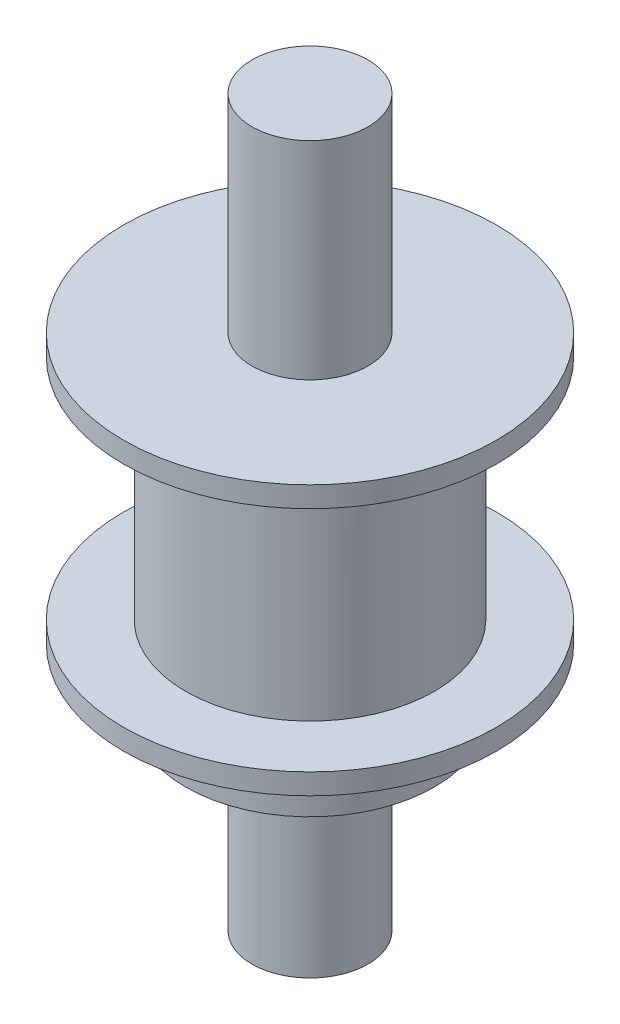
ISO-10303-21;
HEADER;
FILE_DESCRIPTION(('STEP AP214'),'2;1');
FILE_NAME('part.step','',(''),(''),'','','');
FILE_SCHEMA(('AUTOMOTIVE_DESIGN { 1 0 10303 214 1 1 1 1 }'));
ENDSEC;
DATA;
#1=APPLICATION_CONTEXT('core data for automotive mechanical design processes');
#2=APPLICATION_PROTOCOL_DEFINITION('international standard','automotive_design',2000,#1);
#3=PRODUCT_CONTEXT('',#1,'mechanical');
#4=PRODUCT('Part','Part','',(#3));
#5=PRODUCT_RELATED_PRODUCT_CATEGORY('part','',(#4));
#6=PRODUCT_DEFINITION_FORMATION('','',#4);
#7=PRODUCT_DEFINITION_CONTEXT('part definition',#1,'design');
#8=PRODUCT_DEFINITION('design','',#6,#7);
#9=PRODUCT_DEFINITION_SHAPE('','',#8);
#10=(LENGTH_UNIT() NAMED_UNIT(*) SI_UNIT(.MILLI.,.METRE.));
#11=(NAMED_UNIT(*) PLANE_ANGLE_UNIT() SI_UNIT($,.RADIAN.));
#12=(NAMED_UNIT(*) SI_UNIT($,.STERADIAN.) SOLID_ANGLE_UNIT());
#13=UNCERTAINTY_MEASURE_WITH_UNIT(LENGTH_MEASURE(1.E-05),#10,'distance_accuracy_value','');
#14=(GEOMETRIC_REPRESENTATION_CONTEXT(3) GLOBAL_UNCERTAINTY_ASSIGNED_CONTEXT((#13)) GLOBAL_UNIT_ASSIGNED_CONTEXT((#10,
#11,#12)) REPRESENTATION_CONTEXT('',''));
#15=CARTESIAN_POINT('',(0.,0.,0.));
#16=DIRECTION('',(0.,0.,1.));
#17=DIRECTION('',(1.,0.,0.));
#18=AXIS2_PLACEMENT_3D('',#15,#16,#17);
#19=CARTESIAN_POINT('',(-48.,37.9705627484775,40.));
#20=DIRECTION('',(0.,-1.,0.));
#21=DIRECTION('',(0.,0.,-1.));
#22=AXIS2_PLACEMENT_3D('',#19,#20,#21);
#23=CYLINDRICAL_SURFACE('',#22,6.);
#24=CARTESIAN_POINT('',(-48.,17.,40.));
#25=DIRECTION('',(0.,1.,0.));
#26=DIRECTION('',(0.,0.,1.));
#27=AXIS2_PLACEMENT_3D('',#24,#25,#26);
#28=CIRCLE('',#27,6.);
#29=CARTESIAN_POINT('',(-48.,17.,46.));
#30=VERTEX_POINT('',#29);
#31=EDGE_CURVE('E66',#30,#30,#28,.T.);
#32=ORIENTED_EDGE('',*,*,#31,.T.);
#33=EDGE_LOOP('',(#32));
#34=FACE_BOUND('',#33,.T.);
#35=CARTESIAN_POINT('',(-48.,20.0000000000004,40.));
#36=DIRECTION('',(0.,1.,0.));
#37=DIRECTION('',(0.,0.,1.));
#38=AXIS2_PLACEMENT_3D('',#35,#36,#37);
#39=CIRCLE('',#38,6.);
#40=CARTESIAN_POINT('',(-48.,20.0000000000004,46.));
#41=VERTEX_POINT('',#40);
#42=EDGE_CURVE('E40',#41,#41,#39,.T.);
#43=ORIENTED_EDGE('',*,*,#42,.F.);
#44=EDGE_LOOP('',(#43));
#45=FACE_BOUND('',#44,.T.);
#46=ADVANCED_FACE('F36',(#34,#45),#23,.T.);
#47=CARTESIAN_POINT('',(-48.,-1.91959594928934,40.));
#48=DIRECTION('',(0.,1.,0.));
#49=DIRECTION('',(0.,0.,1.));
#50=AXIS2_PLACEMENT_3D('',#47,#48,#49);
#51=CYLINDRICAL_SURFACE('',#50,2.80000000000001);
#52=CARTESIAN_POINT('',(-48.,8.,40.));
#53=DIRECTION('',(0.,1.,0.));
#54=DIRECTION('',(0.,0.,1.));
#55=AXIS2_PLACEMENT_3D('',#52,#53,#54);
#56=CIRCLE('',#55,2.80000000000001);
#57=CARTESIAN_POINT('',(-48.,8.,42.8));
#58=VERTEX_POINT('',#57);
#59=EDGE_CURVE('E73',#58,#58,#56,.F.);
#60=ORIENTED_EDGE('',*,*,#59,.F.);
#61=EDGE_LOOP('',(#60));
#62=FACE_BOUND('',#61,.T.);
#63=CARTESIAN_POINT('',(-48.,17.,40.));
#64=DIRECTION('',(0.,1.,0.));
#65=DIRECTION('',(0.,0.,1.));
#66=AXIS2_PLACEMENT_3D('',#63,#64,#65);
#67=CIRCLE('',#66,2.80000000000001);
#68=CARTESIAN_POINT('',(-48.,17.,42.8));
#69=VERTEX_POINT('',#68);
#70=EDGE_CURVE('E71',#69,#69,#67,.T.);
#71=ORIENTED_EDGE('',*,*,#70,.F.);
#72=EDGE_LOOP('',(#71));
#73=FACE_BOUND('',#72,.T.);
#74=ADVANCED_FACE('F38',(#62,#73),#51,.T.);
#75=CARTESIAN_POINT('',(0.,8.,0.));
#76=DIRECTION('',(0.,1.,0.));
#77=DIRECTION('',(0.,0.,1.));
#78=AXIS2_PLACEMENT_3D('',#75,#76,#77);
#79=PLANE('',#78);
#80=ORIENTED_EDGE('',*,*,#59,.T.);
#81=EDGE_LOOP('',(#80));
#82=FACE_BOUND('',#81,.T.);
#83=ADVANCED_FACE('F89',(#82),#79,.F.);
#84=CARTESIAN_POINT('',(0.,17.,0.));
#85=DIRECTION('',(0.,1.,0.));
#86=DIRECTION('',(0.,0.,1.));
#87=AXIS2_PLACEMENT_3D('',#84,#85,#86);
#88=PLANE('',#87);
#89=ORIENTED_EDGE('',*,*,#70,.T.);
#90=EDGE_LOOP('',(#89));
#91=FACE_BOUND('',#90,.T.);
#92=ORIENTED_EDGE('',*,*,#31,.F.);
#93=EDGE_LOOP('',(#92));
#94=FACE_BOUND('',#93,.T.);
#95=ADVANCED_FACE('F93',(#91,#94),#88,.F.);
#96=CARTESIAN_POINT('',(-48.,20.0000000000004,40.));
#97=DIRECTION('',(0.,1.,0.));
#98=DIRECTION('',(-1.,0.,0.));
#99=AXIS2_PLACEMENT_3D('',#96,#97,#98);
#100=CYLINDRICAL_SURFACE('',#99,9.00000000000001);
#101=CARTESIAN_POINT('',(-48.,20.0000000000004,40.));
#102=DIRECTION('',(0.,1.,0.));
#103=DIRECTION('',(0.,0.,1.));
#104=AXIS2_PLACEMENT_3D('',#101,#102,#103);
#105=CIRCLE('',#104,9.00000000000001);
#106=CARTESIAN_POINT('',(-48.,20.0000000000004,49.));
#107=VERTEX_POINT('',#106);
#108=EDGE_CURVE('E63',#107,#107,#105,.T.);
#109=ORIENTED_EDGE('',*,*,#108,.T.);
#110=EDGE_LOOP('',(#109));
#111=FACE_BOUND('',#110,.T.);
#112=CARTESIAN_POINT('',(-48.,21.0000000000004,40.));
#113=DIRECTION('',(0.,1.,0.));
#114=DIRECTION('',(0.,0.,1.));
#115=AXIS2_PLACEMENT_3D('',#112,#113,#114);
#116=CIRCLE('',#115,9.00000000000001);
#117=CARTESIAN_POINT('',(-48.,21.0000000000004,49.));
#118=VERTEX_POINT('',#117);
#119=EDGE_CURVE('E62',#118,#118,#116,.T.);
#120=ORIENTED_EDGE('',*,*,#119,.F.);
#121=EDGE_LOOP('',(#120));
#122=FACE_BOUND('',#121,.T.);
#123=ADVANCED_FACE('F103',(#111,#122),#100,.T.);
#124=CARTESIAN_POINT('',(0.,20.0000000000004,0.));
#125=DIRECTION('',(0.,1.,0.));
#126=DIRECTION('',(0.,0.,1.));
#127=AXIS2_PLACEMENT_3D('',#124,#125,#126);
#128=PLANE('',#127);
#129=ORIENTED_EDGE('',*,*,#42,.T.);
#130=EDGE_LOOP('',(#129));
#131=FACE_BOUND('',#130,.T.);
#132=ORIENTED_EDGE('',*,*,#108,.F.);
#133=EDGE_LOOP('',(#132));
#134=FACE_BOUND('',#133,.T.);
#135=ADVANCED_FACE('F80',(#131,#134),#128,.F.);
#136=CARTESIAN_POINT('',(-48.,21.0000000000004,1979.));
#137=DIRECTION('',(0.,1.,0.));
#138=DIRECTION('',(-1.,0.,0.));
#139=AXIS2_PLACEMENT_3D('',#136,#137,#138);
#140=PLANE('',#139);
#141=CARTESIAN_POINT('',(-48.,21.0000000000004,40.));
#142=DIRECTION('',(0.,1.,0.));
#143=DIRECTION('',(0.,0.,1.));
#144=AXIS2_PLACEMENT_3D('',#141,#142,#143);
#145=CIRCLE('',#144,6.);
#146=CARTESIAN_POINT('',(-48.,21.0000000000004,46.));
#147=VERTEX_POINT('',#146);
#148=EDGE_CURVE('E44',#147,#147,#145,.T.);
#149=ORIENTED_EDGE('',*,*,#148,.F.);
#150=EDGE_LOOP('',(#149));
#151=FACE_BOUND('',#150,.T.);
#152=ORIENTED_EDGE('',*,*,#119,.T.);
#153=EDGE_LOOP('',(#152));
#154=FACE_BOUND('',#153,.T.);
#155=ADVANCED_FACE('F95',(#151,#154),#140,.T.);
#156=CARTESIAN_POINT('',(-48.,48.9705627484775,40.));
#157=DIRECTION('',(0.,-1.,0.));
#158=DIRECTION('',(1.,0.,0.));
#159=AXIS2_PLACEMENT_3D('',#156,#157,#158);
#160=CYLINDRICAL_SURFACE('',#159,6.);
#161=ORIENTED_EDGE('',*,*,#148,.T.);
#162=EDGE_LOOP('',(#161));
#163=FACE_BOUND('',#162,.T.);
#164=CARTESIAN_POINT('',(-48.,32.0000000000004,40.));
#165=DIRECTION('',(0.,1.,0.));
#166=DIRECTION('',(-1.,0.,0.));
#167=AXIS2_PLACEMENT_3D('',#164,#165,#166);
#168=CIRCLE('',#167,6.);
#169=CARTESIAN_POINT('',(-54.,32.0000000000004,40.));
#170=VERTEX_POINT('',#169);
#171=EDGE_CURVE('E56',#170,#170,#168,.T.);
#172=ORIENTED_EDGE('',*,*,#171,.F.);
#173=EDGE_LOOP('',(#172));
#174=FACE_BOUND('',#173,.T.);
#175=ADVANCED_FACE('F97',(#163,#174),#160,.T.);
#176=CARTESIAN_POINT('',(-48.,33.0000000000004,40.));
#177=DIRECTION('',(0.,-1.,0.));
#178=DIRECTION('',(1.,0.,0.));
#179=AXIS2_PLACEMENT_3D('',#176,#177,#178);
#180=CYLINDRICAL_SURFACE('',#179,9.00000000000001);
#181=CARTESIAN_POINT('',(-48.,33.0000000000004,40.));
#182=DIRECTION('',(0.,1.,0.));
#183=DIRECTION('',(-1.,0.,0.));
#184=AXIS2_PLACEMENT_3D('',#181,#182,#183);
#185=CIRCLE('',#184,9.00000000000001);
#186=CARTESIAN_POINT('',(-57.,33.0000000000004,40.));
#187=VERTEX_POINT('',#186);
#188=EDGE_CURVE('E53',#187,#187,#185,.T.);
#189=ORIENTED_EDGE('',*,*,#188,.F.);
#190=EDGE_LOOP('',(#189));
#191=FACE_BOUND('',#190,.T.);
#192=CARTESIAN_POINT('',(-48.,32.0000000000004,40.));
#193=DIRECTION('',(0.,1.,0.));
#194=DIRECTION('',(-1.,0.,0.));
#195=AXIS2_PLACEMENT_3D('',#192,#193,#194);
#196=CIRCLE('',#195,9.00000000000001);
#197=CARTESIAN_POINT('',(-57.,32.0000000000004,40.));
#198=VERTEX_POINT('',#197);
#199=EDGE_CURVE('E57',#198,#198,#196,.T.);
#200=ORIENTED_EDGE('',*,*,#199,.T.);
#201=EDGE_LOOP('',(#200));
#202=FACE_BOUND('',#201,.T.);
#203=ADVANCED_FACE('F121',(#191,#202),#180,.T.);
#204=CARTESIAN_POINT('',(-48.,33.0000000000004,40.));
#205=DIRECTION('',(0.,1.,0.));
#206=DIRECTION('',(-1.,0.,0.));
#207=AXIS2_PLACEMENT_3D('',#204,#205,#206);
#208=PLANE('',#207);
#209=CARTESIAN_POINT('',(-48.,33.0000000000004,40.));
#210=DIRECTION('',(0.,1.,0.));
#211=DIRECTION('',(-1.,0.,0.));
#212=AXIS2_PLACEMENT_3D('',#209,#210,#211);
#213=CIRCLE('',#212,2.80000000000001);
#214=CARTESIAN_POINT('',(-50.8,33.0000000000004,40.));
#215=VERTEX_POINT('',#214);
#216=EDGE_CURVE('E10',#215,#215,#213,.T.);
#217=ORIENTED_EDGE('',*,*,#216,.F.);
#218=EDGE_LOOP('',(#217));
#219=FACE_BOUND('',#218,.T.);
#220=ORIENTED_EDGE('',*,*,#188,.T.);
#221=EDGE_LOOP('',(#220));
#222=FACE_BOUND('',#221,.T.);
#223=ADVANCED_FACE('F125',(#219,#222),#208,.T.);
#224=CARTESIAN_POINT('',(-48.,32.0000000000004,40.));
#225=DIRECTION('',(0.,1.,0.));
#226=DIRECTION('',(-1.,0.,0.));
#227=AXIS2_PLACEMENT_3D('',#224,#225,#226);
#228=PLANE('',#227);
#229=ORIENTED_EDGE('',*,*,#171,.T.);
#230=EDGE_LOOP('',(#229));
#231=FACE_BOUND('',#230,.T.);
#232=ORIENTED_EDGE('',*,*,#199,.F.);
#233=EDGE_LOOP('',(#232));
#234=FACE_BOUND('',#233,.T.);
#235=ADVANCED_FACE('F127',(#231,#234),#228,.F.);
#236=CARTESIAN_POINT('',(-48.,43.0000000000004,40.));
#237=DIRECTION('',(0.,-1.,0.));
#238=DIRECTION('',(0.,0.,-1.));
#239=AXIS2_PLACEMENT_3D('',#236,#237,#238);
#240=CYLINDRICAL_SURFACE('',#239,2.80000000000001);
#241=CARTESIAN_POINT('',(-48.,43.0000000000004,40.));
#242=DIRECTION('',(0.,1.,0.));
#243=DIRECTION('',(-1.,0.,0.));
#244=AXIS2_PLACEMENT_3D('',#241,#242,#243);
#245=CIRCLE('',#244,2.80000000000001);
#246=CARTESIAN_POINT('',(-50.8,43.0000000000004,40.));
#247=VERTEX_POINT('',#246);
#248=EDGE_CURVE('E52',#247,#247,#245,.T.);
#249=ORIENTED_EDGE('',*,*,#248,.F.);
#250=EDGE_LOOP('',(#249));
#251=FACE_BOUND('',#250,.T.);
#252=ORIENTED_EDGE('',*,*,#216,.T.);
#253=EDGE_LOOP('',(#252));
#254=FACE_BOUND('',#253,.T.);
#255=ADVANCED_FACE('F130',(#251,#254),#240,.T.);
#256=CARTESIAN_POINT('',(-48.,43.0000000000004,40.));
#257=DIRECTION('',(0.,1.,0.));
#258=DIRECTION('',(-1.,0.,0.));
#259=AXIS2_PLACEMENT_3D('',#256,#257,#258);
#260=PLANE('',#259);
#261=ORIENTED_EDGE('',*,*,#248,.T.);
#262=EDGE_LOOP('',(#261));
#263=FACE_BOUND('',#262,.T.);
#264=ADVANCED_FACE('F137',(#263),#260,.T.);
#265=CLOSED_SHELL('',(#46,#74,#83,#95,#123,#135,#155,#175,#203,#223,#235,#255,#264));
#266=MANIFOLD_SOLID_BREP('B2',#265);
#267=ADVANCED_BREP_SHAPE_REPRESENTATION('',(#18,#266),#14);
#268=SHAPE_DEFINITION_REPRESENTATION(#9,#267);
ENDSEC;
END-ISO-10303-21;
